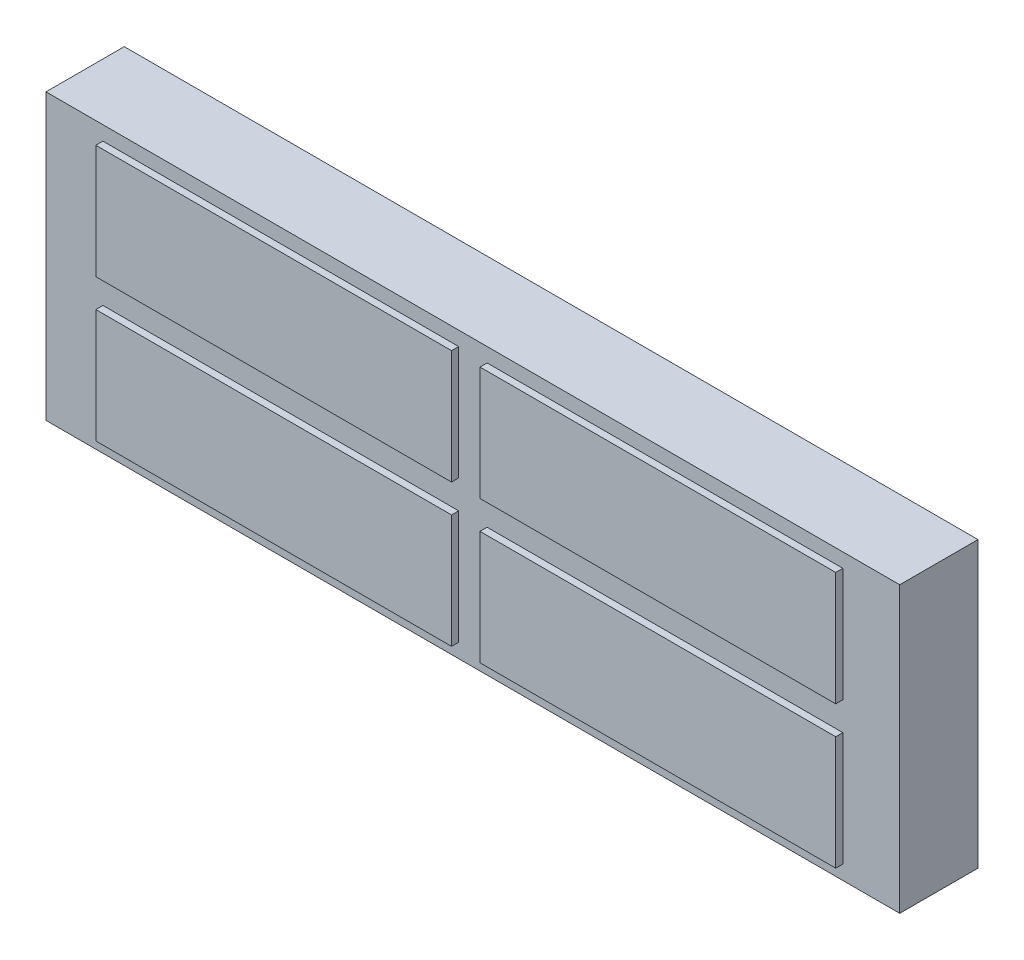
ISO-10303-21;
HEADER;
FILE_DESCRIPTION(('STEP AP214'),'2;1');
FILE_NAME('part.step','',(''),(''),'','','');
FILE_SCHEMA(('AUTOMOTIVE_DESIGN { 1 0 10303 214 1 1 1 1 }'));
ENDSEC;
DATA;
#1=APPLICATION_CONTEXT('core data for automotive mechanical design processes');
#2=APPLICATION_PROTOCOL_DEFINITION('international standard','automotive_design',2000,#1);
#3=PRODUCT_CONTEXT('',#1,'mechanical');
#4=PRODUCT('Part','Part','',(#3));
#5=PRODUCT_RELATED_PRODUCT_CATEGORY('part','',(#4));
#6=PRODUCT_DEFINITION_FORMATION('','',#4);
#7=PRODUCT_DEFINITION_CONTEXT('part definition',#1,'design');
#8=PRODUCT_DEFINITION('design','',#6,#7);
#9=PRODUCT_DEFINITION_SHAPE('','',#8);
#10=(LENGTH_UNIT() NAMED_UNIT(*) SI_UNIT(.MILLI.,.METRE.));
#11=(NAMED_UNIT(*) PLANE_ANGLE_UNIT() SI_UNIT($,.RADIAN.));
#12=(NAMED_UNIT(*) SI_UNIT($,.STERADIAN.) SOLID_ANGLE_UNIT());
#13=UNCERTAINTY_MEASURE_WITH_UNIT(LENGTH_MEASURE(1.E-05),#10,'distance_accuracy_value','');
#14=(GEOMETRIC_REPRESENTATION_CONTEXT(3) GLOBAL_UNCERTAINTY_ASSIGNED_CONTEXT((#13)) GLOBAL_UNIT_ASSIGNED_CONTEXT((#10,
#11,#12)) REPRESENTATION_CONTEXT('',''));
#15=CARTESIAN_POINT('',(0.,0.,0.));
#16=DIRECTION('',(0.,0.,1.));
#17=DIRECTION('',(1.,0.,0.));
#18=AXIS2_PLACEMENT_3D('',#15,#16,#17);
#19=CARTESIAN_POINT('',(0.,20.,5.5));
#20=DIRECTION('',(0.,0.,1.));
#21=DIRECTION('',(1.,0.,0.));
#22=AXIS2_PLACEMENT_3D('',#19,#20,#21);
#23=PLANE('',#22);
#24=DIRECTION('',(1.,0.,0.));
#25=VECTOR('',#24,1.);
#26=CARTESIAN_POINT('',(-29.,11.,5.5));
#27=LINE('',#26,#25);
#28=CARTESIAN_POINT('',(-29.,11.,5.5));
#29=VERTEX_POINT('',#28);
#30=CARTESIAN_POINT('',(-4.,11.,5.5));
#31=VERTEX_POINT('',#30);
#32=EDGE_CURVE('E207',#29,#31,#27,.T.);
#33=ORIENTED_EDGE('',*,*,#32,.F.);
#34=DIRECTION('',(0.,-1.,0.));
#35=VECTOR('',#34,1.);
#36=CARTESIAN_POINT('',(-29.,19.,5.5));
#37=LINE('',#36,#35);
#38=CARTESIAN_POINT('',(-29.,19.,5.5));
#39=VERTEX_POINT('',#38);
#40=EDGE_CURVE('E176',#39,#29,#37,.T.);
#41=ORIENTED_EDGE('',*,*,#40,.F.);
#42=DIRECTION('',(-1.,0.,0.));
#43=VECTOR('',#42,1.);
#44=CARTESIAN_POINT('',(-29.,19.,5.5));
#45=LINE('',#44,#43);
#46=CARTESIAN_POINT('',(-4.,19.,5.5));
#47=VERTEX_POINT('',#46);
#48=EDGE_CURVE('E211',#47,#39,#45,.T.);
#49=ORIENTED_EDGE('',*,*,#48,.F.);
#50=DIRECTION('',(0.,1.,0.));
#51=VECTOR('',#50,1.);
#52=CARTESIAN_POINT('',(-4.,19.,5.5));
#53=LINE('',#52,#51);
#54=EDGE_CURVE('E209',#31,#47,#53,.T.);
#55=ORIENTED_EDGE('',*,*,#54,.F.);
#56=EDGE_LOOP('',(#33,#41,#49,#55));
#57=FACE_BOUND('',#56,.T.);
#58=DIRECTION('',(1.,0.,0.));
#59=VECTOR('',#58,1.);
#60=CARTESIAN_POINT('',(-56.,11.,5.5));
#61=LINE('',#60,#59);
#62=CARTESIAN_POINT('',(-56.,11.,5.5));
#63=VERTEX_POINT('',#62);
#64=CARTESIAN_POINT('',(-31.,11.,5.5));
#65=VERTEX_POINT('',#64);
#66=EDGE_CURVE('E263',#63,#65,#61,.T.);
#67=ORIENTED_EDGE('',*,*,#66,.F.);
#68=DIRECTION('',(0.,-1.,0.));
#69=VECTOR('',#68,1.);
#70=CARTESIAN_POINT('',(-56.,19.,5.5));
#71=LINE('',#70,#69);
#72=CARTESIAN_POINT('',(-56.,19.,5.5));
#73=VERTEX_POINT('',#72);
#74=EDGE_CURVE('E260',#73,#63,#71,.T.);
#75=ORIENTED_EDGE('',*,*,#74,.F.);
#76=DIRECTION('',(-1.,0.,0.));
#77=VECTOR('',#76,1.);
#78=CARTESIAN_POINT('',(-56.,19.,5.5));
#79=LINE('',#78,#77);
#80=CARTESIAN_POINT('',(-31.,19.,5.5));
#81=VERTEX_POINT('',#80);
#82=EDGE_CURVE('E268',#81,#73,#79,.T.);
#83=ORIENTED_EDGE('',*,*,#82,.F.);
#84=DIRECTION('',(0.,1.,0.));
#85=VECTOR('',#84,1.);
#86=CARTESIAN_POINT('',(-31.,19.,5.5));
#87=LINE('',#86,#85);
#88=EDGE_CURVE('E265',#65,#81,#87,.T.);
#89=ORIENTED_EDGE('',*,*,#88,.F.);
#90=EDGE_LOOP('',(#67,#75,#83,#89));
#91=FACE_BOUND('',#90,.T.);
#92=DIRECTION('',(0.,1.,0.));
#93=VECTOR('',#92,1.);
#94=CARTESIAN_POINT('',(0.,0.,5.5));
#95=LINE('',#94,#93);
#96=CARTESIAN_POINT('',(0.,0.,5.5));
#97=VERTEX_POINT('',#96);
#98=CARTESIAN_POINT('',(0.,20.,5.5));
#99=VERTEX_POINT('',#98);
#100=EDGE_CURVE('E298',#97,#99,#95,.T.);
#101=ORIENTED_EDGE('',*,*,#100,.T.);
#102=DIRECTION('',(-1.,0.,0.));
#103=VECTOR('',#102,1.);
#104=CARTESIAN_POINT('',(0.,20.,5.5));
#105=LINE('',#104,#103);
#106=CARTESIAN_POINT('',(-60.,20.,5.5));
#107=VERTEX_POINT('',#106);
#108=EDGE_CURVE('E301',#99,#107,#105,.T.);
#109=ORIENTED_EDGE('',*,*,#108,.T.);
#110=DIRECTION('',(0.,-1.,0.));
#111=VECTOR('',#110,1.);
#112=CARTESIAN_POINT('',(-60.,0.,5.5));
#113=LINE('',#112,#111);
#114=CARTESIAN_POINT('',(-60.,0.,5.5));
#115=VERTEX_POINT('',#114);
#116=EDGE_CURVE('E303',#107,#115,#113,.T.);
#117=ORIENTED_EDGE('',*,*,#116,.T.);
#118=DIRECTION('',(1.,0.,0.));
#119=VECTOR('',#118,1.);
#120=CARTESIAN_POINT('',(0.,0.,5.5));
#121=LINE('',#120,#119);
#122=EDGE_CURVE('E305',#115,#97,#121,.T.);
#123=ORIENTED_EDGE('',*,*,#122,.T.);
#124=EDGE_LOOP('',(#101,#109,#117,#123));
#125=FACE_BOUND('',#124,.T.);
#126=DIRECTION('',(1.,0.,0.));
#127=VECTOR('',#126,1.);
#128=CARTESIAN_POINT('',(-56.,0.999999999999993,5.5));
#129=LINE('',#128,#127);
#130=CARTESIAN_POINT('',(-56.,0.999999999999993,5.5));
#131=VERTEX_POINT('',#130);
#132=CARTESIAN_POINT('',(-31.,0.999999999999992,5.5));
#133=VERTEX_POINT('',#132);
#134=EDGE_CURVE('E234',#131,#133,#129,.T.);
#135=ORIENTED_EDGE('',*,*,#134,.F.);
#136=DIRECTION('',(0.,-1.,0.));
#137=VECTOR('',#136,1.);
#138=CARTESIAN_POINT('',(-56.,8.99999999999999,5.5));
#139=LINE('',#138,#137);
#140=CARTESIAN_POINT('',(-56.,8.99999999999999,5.5));
#141=VERTEX_POINT('',#140);
#142=EDGE_CURVE('E231',#141,#131,#139,.T.);
#143=ORIENTED_EDGE('',*,*,#142,.F.);
#144=DIRECTION('',(-1.,0.,0.));
#145=VECTOR('',#144,1.);
#146=CARTESIAN_POINT('',(-56.,8.99999999999999,5.5));
#147=LINE('',#146,#145);
#148=CARTESIAN_POINT('',(-31.,8.99999999999999,5.5));
#149=VERTEX_POINT('',#148);
#150=EDGE_CURVE('E239',#149,#141,#147,.T.);
#151=ORIENTED_EDGE('',*,*,#150,.F.);
#152=DIRECTION('',(0.,1.,0.));
#153=VECTOR('',#152,1.);
#154=CARTESIAN_POINT('',(-31.,8.99999999999999,5.5));
#155=LINE('',#154,#153);
#156=EDGE_CURVE('E236',#133,#149,#155,.T.);
#157=ORIENTED_EDGE('',*,*,#156,.F.);
#158=EDGE_LOOP('',(#135,#143,#151,#157));
#159=FACE_BOUND('',#158,.T.);
#160=DIRECTION('',(1.,0.,0.));
#161=VECTOR('',#160,1.);
#162=CARTESIAN_POINT('',(-29.,0.999999999999993,5.5));
#163=LINE('',#162,#161);
#164=CARTESIAN_POINT('',(-29.,0.999999999999993,5.5));
#165=VERTEX_POINT('',#164);
#166=CARTESIAN_POINT('',(-4.,0.999999999999993,5.5));
#167=VERTEX_POINT('',#166);
#168=EDGE_CURVE('E170',#165,#167,#163,.T.);
#169=ORIENTED_EDGE('',*,*,#168,.F.);
#170=DIRECTION('',(0.,-1.,0.));
#171=VECTOR('',#170,1.);
#172=CARTESIAN_POINT('',(-29.,8.99999999999999,5.5));
#173=LINE('',#172,#171);
#174=CARTESIAN_POINT('',(-29.,8.99999999999999,5.5));
#175=VERTEX_POINT('',#174);
#176=EDGE_CURVE('E181',#175,#165,#173,.T.);
#177=ORIENTED_EDGE('',*,*,#176,.F.);
#178=DIRECTION('',(-1.,0.,0.));
#179=VECTOR('',#178,1.);
#180=CARTESIAN_POINT('',(-29.,8.99999999999999,5.5));
#181=LINE('',#180,#179);
#182=CARTESIAN_POINT('',(-4.,8.99999999999999,5.5));
#183=VERTEX_POINT('',#182);
#184=EDGE_CURVE('E191',#183,#175,#181,.T.);
#185=ORIENTED_EDGE('',*,*,#184,.F.);
#186=DIRECTION('',(0.,1.,0.));
#187=VECTOR('',#186,1.);
#188=CARTESIAN_POINT('',(-4.,8.99999999999999,5.5));
#189=LINE('',#188,#187);
#190=EDGE_CURVE('E189',#167,#183,#189,.T.);
#191=ORIENTED_EDGE('',*,*,#190,.F.);
#192=EDGE_LOOP('',(#169,#177,#185,#191));
#193=FACE_BOUND('',#192,.T.);
#194=ADVANCED_FACE('F27',(#57,#91,#125,#159,#193),#23,.T.);
#195=CARTESIAN_POINT('',(0.,0.,5.5));
#196=DIRECTION('',(-1.,0.,0.));
#197=DIRECTION('',(0.,0.,1.));
#198=AXIS2_PLACEMENT_3D('',#195,#196,#197);
#199=PLANE('',#198);
#200=DIRECTION('',(0.,1.,0.));
#201=VECTOR('',#200,1.);
#202=CARTESIAN_POINT('',(0.,0.,0.));
#203=LINE('',#202,#201);
#204=CARTESIAN_POINT('',(0.,0.,0.));
#205=VERTEX_POINT('',#204);
#206=CARTESIAN_POINT('',(0.,20.,0.));
#207=VERTEX_POINT('',#206);
#208=EDGE_CURVE('E289',#205,#207,#203,.T.);
#209=ORIENTED_EDGE('',*,*,#208,.T.);
#210=DIRECTION('',(0.,0.,-1.));
#211=VECTOR('',#210,1.);
#212=CARTESIAN_POINT('',(0.,20.,5.5));
#213=LINE('',#212,#211);
#214=EDGE_CURVE('E11',#99,#207,#213,.T.);
#215=ORIENTED_EDGE('',*,*,#214,.F.);
#216=ORIENTED_EDGE('',*,*,#100,.F.);
#217=DIRECTION('',(0.,0.,-1.));
#218=VECTOR('',#217,1.);
#219=CARTESIAN_POINT('',(0.,0.,5.5));
#220=LINE('',#219,#218);
#221=EDGE_CURVE('E307',#97,#205,#220,.T.);
#222=ORIENTED_EDGE('',*,*,#221,.T.);
#223=EDGE_LOOP('',(#209,#215,#216,#222));
#224=FACE_BOUND('',#223,.T.);
#225=ADVANCED_FACE('F29',(#224),#199,.F.);
#226=CARTESIAN_POINT('',(0.,20.,5.5));
#227=DIRECTION('',(0.,-1.,0.));
#228=DIRECTION('',(1.,0.,0.));
#229=AXIS2_PLACEMENT_3D('',#226,#227,#228);
#230=PLANE('',#229);
#231=DIRECTION('',(-1.,0.,0.));
#232=VECTOR('',#231,1.);
#233=CARTESIAN_POINT('',(0.,20.,0.));
#234=LINE('',#233,#232);
#235=CARTESIAN_POINT('',(-60.,20.,0.));
#236=VERTEX_POINT('',#235);
#237=EDGE_CURVE('E292',#207,#236,#234,.T.);
#238=ORIENTED_EDGE('',*,*,#237,.T.);
#239=DIRECTION('',(0.,0.,-1.));
#240=VECTOR('',#239,1.);
#241=CARTESIAN_POINT('',(-60.,20.,5.5));
#242=LINE('',#241,#240);
#243=EDGE_CURVE('E35',#107,#236,#242,.T.);
#244=ORIENTED_EDGE('',*,*,#243,.F.);
#245=ORIENTED_EDGE('',*,*,#108,.F.);
#246=ORIENTED_EDGE('',*,*,#214,.T.);
#247=EDGE_LOOP('',(#238,#244,#245,#246));
#248=FACE_BOUND('',#247,.T.);
#249=ADVANCED_FACE('F333',(#248),#230,.F.);
#250=CARTESIAN_POINT('',(-60.,0.,5.5));
#251=DIRECTION('',(1.,0.,0.));
#252=DIRECTION('',(0.,0.,-1.));
#253=AXIS2_PLACEMENT_3D('',#250,#251,#252);
#254=PLANE('',#253);
#255=DIRECTION('',(0.,-1.,0.));
#256=VECTOR('',#255,1.);
#257=CARTESIAN_POINT('',(-60.,0.,0.));
#258=LINE('',#257,#256);
#259=CARTESIAN_POINT('',(-60.,0.,0.));
#260=VERTEX_POINT('',#259);
#261=EDGE_CURVE('E294',#236,#260,#258,.T.);
#262=ORIENTED_EDGE('',*,*,#261,.T.);
#263=DIRECTION('',(0.,0.,-1.));
#264=VECTOR('',#263,1.);
#265=CARTESIAN_POINT('',(-60.,0.,5.5));
#266=LINE('',#265,#264);
#267=EDGE_CURVE('E310',#115,#260,#266,.T.);
#268=ORIENTED_EDGE('',*,*,#267,.F.);
#269=ORIENTED_EDGE('',*,*,#116,.F.);
#270=ORIENTED_EDGE('',*,*,#243,.T.);
#271=EDGE_LOOP('',(#262,#268,#269,#270));
#272=FACE_BOUND('',#271,.T.);
#273=ADVANCED_FACE('F317',(#272),#254,.F.);
#274=CARTESIAN_POINT('',(0.,0.,5.5));
#275=DIRECTION('',(0.,1.,0.));
#276=DIRECTION('',(-1.,0.,0.));
#277=AXIS2_PLACEMENT_3D('',#274,#275,#276);
#278=PLANE('',#277);
#279=DIRECTION('',(1.,0.,0.));
#280=VECTOR('',#279,1.);
#281=CARTESIAN_POINT('',(0.,0.,0.));
#282=LINE('',#281,#280);
#283=EDGE_CURVE('E296',#260,#205,#282,.T.);
#284=ORIENTED_EDGE('',*,*,#283,.T.);
#285=ORIENTED_EDGE('',*,*,#221,.F.);
#286=ORIENTED_EDGE('',*,*,#122,.F.);
#287=ORIENTED_EDGE('',*,*,#267,.T.);
#288=EDGE_LOOP('',(#284,#285,#286,#287));
#289=FACE_BOUND('',#288,.T.);
#290=ADVANCED_FACE('F326',(#289),#278,.F.);
#291=CARTESIAN_POINT('',(0.,20.,0.));
#292=DIRECTION('',(0.,0.,1.));
#293=DIRECTION('',(1.,0.,0.));
#294=AXIS2_PLACEMENT_3D('',#291,#292,#293);
#295=PLANE('',#294);
#296=ORIENTED_EDGE('',*,*,#208,.F.);
#297=ORIENTED_EDGE('',*,*,#283,.F.);
#298=ORIENTED_EDGE('',*,*,#261,.F.);
#299=ORIENTED_EDGE('',*,*,#237,.F.);
#300=EDGE_LOOP('',(#296,#297,#298,#299));
#301=FACE_BOUND('',#300,.T.);
#302=ADVANCED_FACE('F323',(#301),#295,.F.);
#303=CARTESIAN_POINT('',(-56.,19.,6.));
#304=DIRECTION('',(1.,0.,0.));
#305=DIRECTION('',(0.,0.,-1.));
#306=AXIS2_PLACEMENT_3D('',#303,#304,#305);
#307=PLANE('',#306);
#308=ORIENTED_EDGE('',*,*,#74,.T.);
#309=DIRECTION('',(0.,0.,-1.));
#310=VECTOR('',#309,1.);
#311=CARTESIAN_POINT('',(-56.,11.,6.));
#312=LINE('',#311,#310);
#313=CARTESIAN_POINT('',(-56.,11.,6.));
#314=VERTEX_POINT('',#313);
#315=EDGE_CURVE('E287',#314,#63,#312,.T.);
#316=ORIENTED_EDGE('',*,*,#315,.F.);
#317=DIRECTION('',(0.,-1.,0.));
#318=VECTOR('',#317,1.);
#319=CARTESIAN_POINT('',(-56.,19.,6.));
#320=LINE('',#319,#318);
#321=CARTESIAN_POINT('',(-56.,19.,6.));
#322=VERTEX_POINT('',#321);
#323=EDGE_CURVE('E270',#322,#314,#320,.T.);
#324=ORIENTED_EDGE('',*,*,#323,.F.);
#325=DIRECTION('',(0.,0.,-1.));
#326=VECTOR('',#325,1.);
#327=CARTESIAN_POINT('',(-56.,19.,6.));
#328=LINE('',#327,#326);
#329=EDGE_CURVE('E279',#322,#73,#328,.T.);
#330=ORIENTED_EDGE('',*,*,#329,.T.);
#331=EDGE_LOOP('',(#308,#316,#324,#330));
#332=FACE_BOUND('',#331,.T.);
#333=ADVANCED_FACE('F355',(#332),#307,.F.);
#334=CARTESIAN_POINT('',(-56.,11.,6.));
#335=DIRECTION('',(0.,1.,0.));
#336=DIRECTION('',(0.,0.,1.));
#337=AXIS2_PLACEMENT_3D('',#334,#335,#336);
#338=PLANE('',#337);
#339=ORIENTED_EDGE('',*,*,#66,.T.);
#340=DIRECTION('',(0.,0.,-1.));
#341=VECTOR('',#340,1.);
#342=CARTESIAN_POINT('',(-31.,11.,6.));
#343=LINE('',#342,#341);
#344=CARTESIAN_POINT('',(-31.,11.,6.));
#345=VERTEX_POINT('',#344);
#346=EDGE_CURVE('E284',#345,#65,#343,.T.);
#347=ORIENTED_EDGE('',*,*,#346,.F.);
#348=DIRECTION('',(1.,0.,0.));
#349=VECTOR('',#348,1.);
#350=CARTESIAN_POINT('',(-56.,11.,6.));
#351=LINE('',#350,#349);
#352=EDGE_CURVE('E273',#314,#345,#351,.T.);
#353=ORIENTED_EDGE('',*,*,#352,.F.);
#354=ORIENTED_EDGE('',*,*,#315,.T.);
#355=EDGE_LOOP('',(#339,#347,#353,#354));
#356=FACE_BOUND('',#355,.T.);
#357=ADVANCED_FACE('F358',(#356),#338,.F.);
#358=CARTESIAN_POINT('',(-31.,19.,6.));
#359=DIRECTION('',(-1.,0.,0.));
#360=DIRECTION('',(0.,0.,1.));
#361=AXIS2_PLACEMENT_3D('',#358,#359,#360);
#362=PLANE('',#361);
#363=ORIENTED_EDGE('',*,*,#88,.T.);
#364=DIRECTION('',(0.,0.,-1.));
#365=VECTOR('',#364,1.);
#366=CARTESIAN_POINT('',(-31.,19.,6.));
#367=LINE('',#366,#365);
#368=CARTESIAN_POINT('',(-31.,19.,6.));
#369=VERTEX_POINT('',#368);
#370=EDGE_CURVE('E282',#369,#81,#367,.T.);
#371=ORIENTED_EDGE('',*,*,#370,.F.);
#372=DIRECTION('',(0.,1.,0.));
#373=VECTOR('',#372,1.);
#374=CARTESIAN_POINT('',(-31.,19.,6.));
#375=LINE('',#374,#373);
#376=EDGE_CURVE('E275',#345,#369,#375,.T.);
#377=ORIENTED_EDGE('',*,*,#376,.F.);
#378=ORIENTED_EDGE('',*,*,#346,.T.);
#379=EDGE_LOOP('',(#363,#371,#377,#378));
#380=FACE_BOUND('',#379,.T.);
#381=ADVANCED_FACE('F363',(#380),#362,.F.);
#382=CARTESIAN_POINT('',(-56.,19.,6.));
#383=DIRECTION('',(0.,-1.,0.));
#384=DIRECTION('',(0.,0.,-1.));
#385=AXIS2_PLACEMENT_3D('',#382,#383,#384);
#386=PLANE('',#385);
#387=ORIENTED_EDGE('',*,*,#82,.T.);
#388=ORIENTED_EDGE('',*,*,#329,.F.);
#389=DIRECTION('',(-1.,0.,0.));
#390=VECTOR('',#389,1.);
#391=CARTESIAN_POINT('',(-56.,19.,6.));
#392=LINE('',#391,#390);
#393=EDGE_CURVE('E277',#369,#322,#392,.T.);
#394=ORIENTED_EDGE('',*,*,#393,.F.);
#395=ORIENTED_EDGE('',*,*,#370,.T.);
#396=EDGE_LOOP('',(#387,#388,#394,#395));
#397=FACE_BOUND('',#396,.T.);
#398=ADVANCED_FACE('F369',(#397),#386,.F.);
#399=CARTESIAN_POINT('',(-56.,11.,6.));
#400=DIRECTION('',(0.,0.,1.));
#401=DIRECTION('',(1.,0.,0.));
#402=AXIS2_PLACEMENT_3D('',#399,#400,#401);
#403=PLANE('',#402);
#404=ORIENTED_EDGE('',*,*,#323,.T.);
#405=ORIENTED_EDGE('',*,*,#352,.T.);
#406=ORIENTED_EDGE('',*,*,#376,.T.);
#407=ORIENTED_EDGE('',*,*,#393,.T.);
#408=EDGE_LOOP('',(#404,#405,#406,#407));
#409=FACE_BOUND('',#408,.T.);
#410=ADVANCED_FACE('F373',(#409),#403,.T.);
#411=CARTESIAN_POINT('',(-56.,8.99999999999999,6.));
#412=DIRECTION('',(1.,0.,0.));
#413=DIRECTION('',(0.,0.,-1.));
#414=AXIS2_PLACEMENT_3D('',#411,#412,#413);
#415=PLANE('',#414);
#416=ORIENTED_EDGE('',*,*,#142,.T.);
#417=DIRECTION('',(0.,0.,-1.));
#418=VECTOR('',#417,1.);
#419=CARTESIAN_POINT('',(-56.,0.999999999999993,6.));
#420=LINE('',#419,#418);
#421=CARTESIAN_POINT('',(-56.,0.999999999999993,6.));
#422=VERTEX_POINT('',#421);
#423=EDGE_CURVE('E258',#422,#131,#420,.T.);
#424=ORIENTED_EDGE('',*,*,#423,.F.);
#425=DIRECTION('',(0.,-1.,0.));
#426=VECTOR('',#425,1.);
#427=CARTESIAN_POINT('',(-56.,8.99999999999999,6.));
#428=LINE('',#427,#426);
#429=CARTESIAN_POINT('',(-56.,8.99999999999999,6.));
#430=VERTEX_POINT('',#429);
#431=EDGE_CURVE('E241',#430,#422,#428,.T.);
#432=ORIENTED_EDGE('',*,*,#431,.F.);
#433=DIRECTION('',(0.,0.,-1.));
#434=VECTOR('',#433,1.);
#435=CARTESIAN_POINT('',(-56.,8.99999999999999,6.));
#436=LINE('',#435,#434);
#437=EDGE_CURVE('E250',#430,#141,#436,.T.);
#438=ORIENTED_EDGE('',*,*,#437,.T.);
#439=EDGE_LOOP('',(#416,#424,#432,#438));
#440=FACE_BOUND('',#439,.T.);
#441=ADVANCED_FACE('F377',(#440),#415,.F.);
#442=CARTESIAN_POINT('',(-56.,0.999999999999993,6.));
#443=DIRECTION('',(0.,1.,0.));
#444=DIRECTION('',(-1.,0.,0.));
#445=AXIS2_PLACEMENT_3D('',#442,#443,#444);
#446=PLANE('',#445);
#447=ORIENTED_EDGE('',*,*,#134,.T.);
#448=DIRECTION('',(0.,0.,-1.));
#449=VECTOR('',#448,1.);
#450=CARTESIAN_POINT('',(-31.,0.999999999999992,6.));
#451=LINE('',#450,#449);
#452=CARTESIAN_POINT('',(-31.,0.999999999999992,6.));
#453=VERTEX_POINT('',#452);
#454=EDGE_CURVE('E255',#453,#133,#451,.T.);
#455=ORIENTED_EDGE('',*,*,#454,.F.);
#456=DIRECTION('',(1.,0.,0.));
#457=VECTOR('',#456,1.);
#458=CARTESIAN_POINT('',(-56.,0.999999999999993,6.));
#459=LINE('',#458,#457);
#460=EDGE_CURVE('E244',#422,#453,#459,.T.);
#461=ORIENTED_EDGE('',*,*,#460,.F.);
#462=ORIENTED_EDGE('',*,*,#423,.T.);
#463=EDGE_LOOP('',(#447,#455,#461,#462));
#464=FACE_BOUND('',#463,.T.);
#465=ADVANCED_FACE('F381',(#464),#446,.F.);
#466=CARTESIAN_POINT('',(-31.,8.99999999999999,6.));
#467=DIRECTION('',(-1.,0.,0.));
#468=DIRECTION('',(0.,0.,1.));
#469=AXIS2_PLACEMENT_3D('',#466,#467,#468);
#470=PLANE('',#469);
#471=ORIENTED_EDGE('',*,*,#156,.T.);
#472=DIRECTION('',(0.,0.,-1.));
#473=VECTOR('',#472,1.);
#474=CARTESIAN_POINT('',(-31.,8.99999999999999,6.));
#475=LINE('',#474,#473);
#476=CARTESIAN_POINT('',(-31.,8.99999999999999,6.));
#477=VERTEX_POINT('',#476);
#478=EDGE_CURVE('E253',#477,#149,#475,.T.);
#479=ORIENTED_EDGE('',*,*,#478,.F.);
#480=DIRECTION('',(0.,1.,0.));
#481=VECTOR('',#480,1.);
#482=CARTESIAN_POINT('',(-31.,8.99999999999999,6.));
#483=LINE('',#482,#481);
#484=EDGE_CURVE('E246',#453,#477,#483,.T.);
#485=ORIENTED_EDGE('',*,*,#484,.F.);
#486=ORIENTED_EDGE('',*,*,#454,.T.);
#487=EDGE_LOOP('',(#471,#479,#485,#486));
#488=FACE_BOUND('',#487,.T.);
#489=ADVANCED_FACE('F385',(#488),#470,.F.);
#490=CARTESIAN_POINT('',(-56.,8.99999999999999,6.));
#491=DIRECTION('',(0.,-1.,0.));
#492=DIRECTION('',(0.,0.,-1.));
#493=AXIS2_PLACEMENT_3D('',#490,#491,#492);
#494=PLANE('',#493);
#495=ORIENTED_EDGE('',*,*,#150,.T.);
#496=ORIENTED_EDGE('',*,*,#437,.F.);
#497=DIRECTION('',(-1.,0.,0.));
#498=VECTOR('',#497,1.);
#499=CARTESIAN_POINT('',(-56.,8.99999999999999,6.));
#500=LINE('',#499,#498);
#501=EDGE_CURVE('E248',#477,#430,#500,.T.);
#502=ORIENTED_EDGE('',*,*,#501,.F.);
#503=ORIENTED_EDGE('',*,*,#478,.T.);
#504=EDGE_LOOP('',(#495,#496,#502,#503));
#505=FACE_BOUND('',#504,.T.);
#506=ADVANCED_FACE('F389',(#505),#494,.F.);
#507=CARTESIAN_POINT('',(-56.,8.99999999999999,6.));
#508=DIRECTION('',(0.,0.,1.));
#509=DIRECTION('',(1.,0.,0.));
#510=AXIS2_PLACEMENT_3D('',#507,#508,#509);
#511=PLANE('',#510);
#512=ORIENTED_EDGE('',*,*,#431,.T.);
#513=ORIENTED_EDGE('',*,*,#460,.T.);
#514=ORIENTED_EDGE('',*,*,#484,.T.);
#515=ORIENTED_EDGE('',*,*,#501,.T.);
#516=EDGE_LOOP('',(#512,#513,#514,#515));
#517=FACE_BOUND('',#516,.T.);
#518=ADVANCED_FACE('F393',(#517),#511,.T.);
#519=CARTESIAN_POINT('',(-29.,19.,6.));
#520=DIRECTION('',(1.,0.,0.));
#521=DIRECTION('',(0.,0.,-1.));
#522=AXIS2_PLACEMENT_3D('',#519,#520,#521);
#523=PLANE('',#522);
#524=ORIENTED_EDGE('',*,*,#40,.T.);
#525=DIRECTION('',(0.,0.,-1.));
#526=VECTOR('',#525,1.);
#527=CARTESIAN_POINT('',(-29.,11.,6.));
#528=LINE('',#527,#526);
#529=CARTESIAN_POINT('',(-29.,11.,6.));
#530=VERTEX_POINT('',#529);
#531=EDGE_CURVE('E229',#530,#29,#528,.T.);
#532=ORIENTED_EDGE('',*,*,#531,.F.);
#533=DIRECTION('',(0.,-1.,0.));
#534=VECTOR('',#533,1.);
#535=CARTESIAN_POINT('',(-29.,19.,6.));
#536=LINE('',#535,#534);
#537=CARTESIAN_POINT('',(-29.,19.,6.));
#538=VERTEX_POINT('',#537);
#539=EDGE_CURVE('E213',#538,#530,#536,.T.);
#540=ORIENTED_EDGE('',*,*,#539,.F.);
#541=DIRECTION('',(0.,0.,-1.));
#542=VECTOR('',#541,1.);
#543=CARTESIAN_POINT('',(-29.,19.,6.));
#544=LINE('',#543,#542);
#545=EDGE_CURVE('E222',#538,#39,#544,.T.);
#546=ORIENTED_EDGE('',*,*,#545,.T.);
#547=EDGE_LOOP('',(#524,#532,#540,#546));
#548=FACE_BOUND('',#547,.T.);
#549=ADVANCED_FACE('F397',(#548),#523,.F.);
#550=CARTESIAN_POINT('',(-29.,11.,6.));
#551=DIRECTION('',(0.,1.,0.));
#552=DIRECTION('',(0.,0.,1.));
#553=AXIS2_PLACEMENT_3D('',#550,#551,#552);
#554=PLANE('',#553);
#555=ORIENTED_EDGE('',*,*,#32,.T.);
#556=DIRECTION('',(0.,0.,-1.));
#557=VECTOR('',#556,1.);
#558=CARTESIAN_POINT('',(-4.,11.,6.));
#559=LINE('',#558,#557);
#560=CARTESIAN_POINT('',(-4.,11.,6.));
#561=VERTEX_POINT('',#560);
#562=EDGE_CURVE('E226',#561,#31,#559,.T.);
#563=ORIENTED_EDGE('',*,*,#562,.F.);
#564=DIRECTION('',(1.,0.,0.));
#565=VECTOR('',#564,1.);
#566=CARTESIAN_POINT('',(-29.,11.,6.));
#567=LINE('',#566,#565);
#568=EDGE_CURVE('E216',#530,#561,#567,.T.);
#569=ORIENTED_EDGE('',*,*,#568,.F.);
#570=ORIENTED_EDGE('',*,*,#531,.T.);
#571=EDGE_LOOP('',(#555,#563,#569,#570));
#572=FACE_BOUND('',#571,.T.);
#573=ADVANCED_FACE('F401',(#572),#554,.F.);
#574=CARTESIAN_POINT('',(-4.,19.,6.));
#575=DIRECTION('',(-1.,0.,0.));
#576=DIRECTION('',(0.,0.,1.));
#577=AXIS2_PLACEMENT_3D('',#574,#575,#576);
#578=PLANE('',#577);
#579=ORIENTED_EDGE('',*,*,#54,.T.);
#580=DIRECTION('',(0.,0.,-1.));
#581=VECTOR('',#580,1.);
#582=CARTESIAN_POINT('',(-4.,19.,6.));
#583=LINE('',#582,#581);
#584=CARTESIAN_POINT('',(-4.,19.,6.));
#585=VERTEX_POINT('',#584);
#586=EDGE_CURVE('E50',#585,#47,#583,.T.);
#587=ORIENTED_EDGE('',*,*,#586,.F.);
#588=DIRECTION('',(0.,1.,0.));
#589=VECTOR('',#588,1.);
#590=CARTESIAN_POINT('',(-4.,19.,6.));
#591=LINE('',#590,#589);
#592=EDGE_CURVE('E218',#561,#585,#591,.T.);
#593=ORIENTED_EDGE('',*,*,#592,.F.);
#594=ORIENTED_EDGE('',*,*,#562,.T.);
#595=EDGE_LOOP('',(#579,#587,#593,#594));
#596=FACE_BOUND('',#595,.T.);
#597=ADVANCED_FACE('F405',(#596),#578,.F.);
#598=CARTESIAN_POINT('',(-29.,19.,6.));
#599=DIRECTION('',(0.,-1.,0.));
#600=DIRECTION('',(0.,0.,-1.));
#601=AXIS2_PLACEMENT_3D('',#598,#599,#600);
#602=PLANE('',#601);
#603=ORIENTED_EDGE('',*,*,#48,.T.);
#604=ORIENTED_EDGE('',*,*,#545,.F.);
#605=DIRECTION('',(-1.,0.,0.));
#606=VECTOR('',#605,1.);
#607=CARTESIAN_POINT('',(-29.,19.,6.));
#608=LINE('',#607,#606);
#609=EDGE_CURVE('E220',#585,#538,#608,.T.);
#610=ORIENTED_EDGE('',*,*,#609,.F.);
#611=ORIENTED_EDGE('',*,*,#586,.T.);
#612=EDGE_LOOP('',(#603,#604,#610,#611));
#613=FACE_BOUND('',#612,.T.);
#614=ADVANCED_FACE('F409',(#613),#602,.F.);
#615=CARTESIAN_POINT('',(-29.,11.,6.));
#616=DIRECTION('',(0.,0.,1.));
#617=DIRECTION('',(1.,0.,0.));
#618=AXIS2_PLACEMENT_3D('',#615,#616,#617);
#619=PLANE('',#618);
#620=ORIENTED_EDGE('',*,*,#539,.T.);
#621=ORIENTED_EDGE('',*,*,#568,.T.);
#622=ORIENTED_EDGE('',*,*,#592,.T.);
#623=ORIENTED_EDGE('',*,*,#609,.T.);
#624=EDGE_LOOP('',(#620,#621,#622,#623));
#625=FACE_BOUND('',#624,.T.);
#626=ADVANCED_FACE('F413',(#625),#619,.T.);
#627=CARTESIAN_POINT('',(-29.,8.99999999999999,6.));
#628=DIRECTION('',(1.,0.,0.));
#629=DIRECTION('',(0.,1.,0.));
#630=AXIS2_PLACEMENT_3D('',#627,#628,#629);
#631=PLANE('',#630);
#632=ORIENTED_EDGE('',*,*,#176,.T.);
#633=DIRECTION('',(0.,0.,-1.));
#634=VECTOR('',#633,1.);
#635=CARTESIAN_POINT('',(-29.,0.999999999999993,6.));
#636=LINE('',#635,#634);
#637=CARTESIAN_POINT('',(-29.,0.999999999999993,6.));
#638=VERTEX_POINT('',#637);
#639=EDGE_CURVE('E165',#638,#165,#636,.T.);
#640=ORIENTED_EDGE('',*,*,#639,.F.);
#641=DIRECTION('',(0.,-1.,0.));
#642=VECTOR('',#641,1.);
#643=CARTESIAN_POINT('',(-29.,8.99999999999999,6.));
#644=LINE('',#643,#642);
#645=CARTESIAN_POINT('',(-29.,8.99999999999999,6.));
#646=VERTEX_POINT('',#645);
#647=EDGE_CURVE('E195',#646,#638,#644,.T.);
#648=ORIENTED_EDGE('',*,*,#647,.F.);
#649=DIRECTION('',(0.,0.,-1.));
#650=VECTOR('',#649,1.);
#651=CARTESIAN_POINT('',(-29.,8.99999999999999,6.));
#652=LINE('',#651,#650);
#653=EDGE_CURVE('E184',#646,#175,#652,.T.);
#654=ORIENTED_EDGE('',*,*,#653,.T.);
#655=EDGE_LOOP('',(#632,#640,#648,#654));
#656=FACE_BOUND('',#655,.T.);
#657=ADVANCED_FACE('F182',(#656),#631,.F.);
#658=CARTESIAN_POINT('',(-29.,0.999999999999993,6.));
#659=DIRECTION('',(0.,1.,0.));
#660=DIRECTION('',(0.,0.,1.));
#661=AXIS2_PLACEMENT_3D('',#658,#659,#660);
#662=PLANE('',#661);
#663=ORIENTED_EDGE('',*,*,#168,.T.);
#664=DIRECTION('',(0.,0.,-1.));
#665=VECTOR('',#664,1.);
#666=CARTESIAN_POINT('',(-4.,0.999999999999993,6.));
#667=LINE('',#666,#665);
#668=CARTESIAN_POINT('',(-4.,0.999999999999993,6.));
#669=VERTEX_POINT('',#668);
#670=EDGE_CURVE('E177',#669,#167,#667,.T.);
#671=ORIENTED_EDGE('',*,*,#670,.F.);
#672=DIRECTION('',(1.,0.,0.));
#673=VECTOR('',#672,1.);
#674=CARTESIAN_POINT('',(-29.,0.999999999999993,6.));
#675=LINE('',#674,#673);
#676=EDGE_CURVE('E172',#638,#669,#675,.T.);
#677=ORIENTED_EDGE('',*,*,#676,.F.);
#678=ORIENTED_EDGE('',*,*,#639,.T.);
#679=EDGE_LOOP('',(#663,#671,#677,#678));
#680=FACE_BOUND('',#679,.T.);
#681=ADVANCED_FACE('F167',(#680),#662,.F.);
#682=CARTESIAN_POINT('',(-4.,8.99999999999999,6.));
#683=DIRECTION('',(-1.,0.,0.));
#684=DIRECTION('',(0.,-1.,0.));
#685=AXIS2_PLACEMENT_3D('',#682,#683,#684);
#686=PLANE('',#685);
#687=ORIENTED_EDGE('',*,*,#190,.T.);
#688=DIRECTION('',(0.,0.,-1.));
#689=VECTOR('',#688,1.);
#690=CARTESIAN_POINT('',(-4.,8.99999999999999,6.));
#691=LINE('',#690,#689);
#692=CARTESIAN_POINT('',(-4.,8.99999999999999,6.));
#693=VERTEX_POINT('',#692);
#694=EDGE_CURVE('E42',#693,#183,#691,.T.);
#695=ORIENTED_EDGE('',*,*,#694,.F.);
#696=DIRECTION('',(0.,1.,0.));
#697=VECTOR('',#696,1.);
#698=CARTESIAN_POINT('',(-4.,8.99999999999999,6.));
#699=LINE('',#698,#697);
#700=EDGE_CURVE('E198',#669,#693,#699,.T.);
#701=ORIENTED_EDGE('',*,*,#700,.F.);
#702=ORIENTED_EDGE('',*,*,#670,.T.);
#703=EDGE_LOOP('',(#687,#695,#701,#702));
#704=FACE_BOUND('',#703,.T.);
#705=ADVANCED_FACE('F421',(#704),#686,.F.);
#706=CARTESIAN_POINT('',(-29.,8.99999999999999,6.));
#707=DIRECTION('',(0.,-1.,0.));
#708=DIRECTION('',(0.,0.,-1.));
#709=AXIS2_PLACEMENT_3D('',#706,#707,#708);
#710=PLANE('',#709);
#711=ORIENTED_EDGE('',*,*,#184,.T.);
#712=ORIENTED_EDGE('',*,*,#653,.F.);
#713=DIRECTION('',(-1.,0.,0.));
#714=VECTOR('',#713,1.);
#715=CARTESIAN_POINT('',(-29.,8.99999999999999,6.));
#716=LINE('',#715,#714);
#717=EDGE_CURVE('E200',#693,#646,#716,.T.);
#718=ORIENTED_EDGE('',*,*,#717,.F.);
#719=ORIENTED_EDGE('',*,*,#694,.T.);
#720=EDGE_LOOP('',(#711,#712,#718,#719));
#721=FACE_BOUND('',#720,.T.);
#722=ADVANCED_FACE('F424',(#721),#710,.F.);
#723=CARTESIAN_POINT('',(-29.,0.999999999999993,6.));
#724=DIRECTION('',(0.,0.,1.));
#725=DIRECTION('',(1.,0.,0.));
#726=AXIS2_PLACEMENT_3D('',#723,#724,#725);
#727=PLANE('',#726);
#728=ORIENTED_EDGE('',*,*,#647,.T.);
#729=ORIENTED_EDGE('',*,*,#676,.T.);
#730=ORIENTED_EDGE('',*,*,#700,.T.);
#731=ORIENTED_EDGE('',*,*,#717,.T.);
#732=EDGE_LOOP('',(#728,#729,#730,#731));
#733=FACE_BOUND('',#732,.T.);
#734=ADVANCED_FACE('F428',(#733),#727,.T.);
#735=CLOSED_SHELL('',(#194,#225,#249,#273,#290,#302,#333,#357,#381,#398,#410,#441,#465,#489,
#506,#518,#549,#573,#597,#614,#626,#657,#681,#705,#722,#734));
#736=MANIFOLD_SOLID_BREP('B2',#735);
#737=ADVANCED_BREP_SHAPE_REPRESENTATION('',(#18,#736),#14);
#738=SHAPE_DEFINITION_REPRESENTATION(#9,#737);
ENDSEC;
END-ISO-10303-21;
